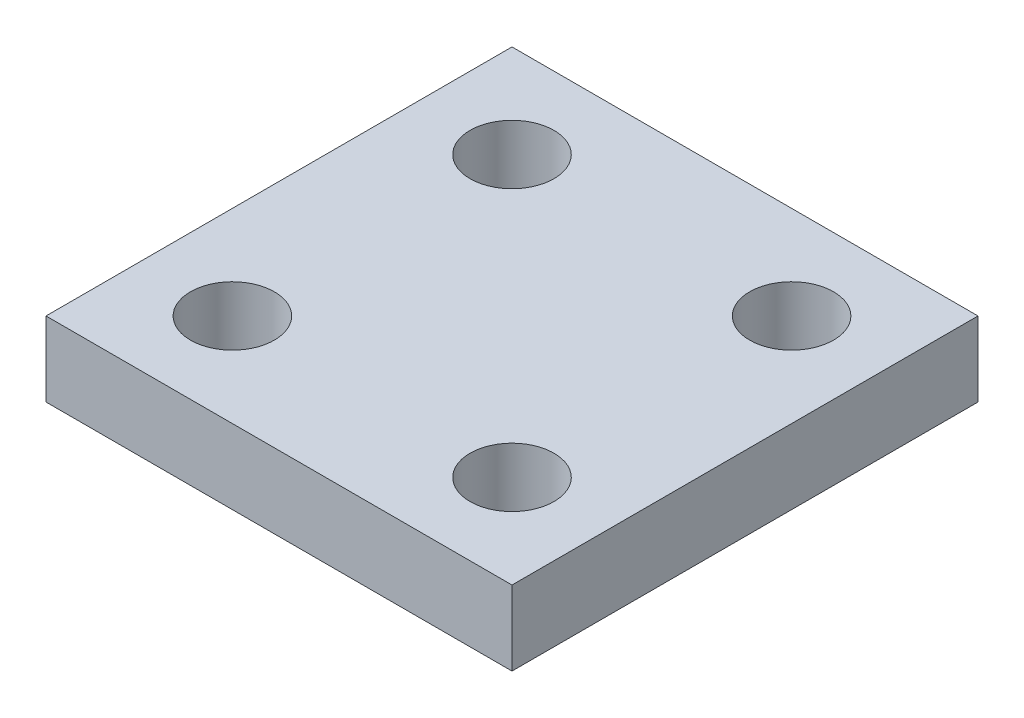
ISO-10303-21;
HEADER;
FILE_DESCRIPTION(('STEP AP214'),'2;1');
FILE_NAME('part.step','',(''),(''),'','','');
FILE_SCHEMA(('AUTOMOTIVE_DESIGN { 1 0 10303 214 1 1 1 1 }'));
ENDSEC;
DATA;
#1=APPLICATION_CONTEXT('core data for automotive mechanical design processes');
#2=APPLICATION_PROTOCOL_DEFINITION('international standard','automotive_design',2000,#1);
#3=PRODUCT_CONTEXT('',#1,'mechanical');
#4=PRODUCT('Part','Part','',(#3));
#5=PRODUCT_RELATED_PRODUCT_CATEGORY('part','',(#4));
#6=PRODUCT_DEFINITION_FORMATION('','',#4);
#7=PRODUCT_DEFINITION_CONTEXT('part definition',#1,'design');
#8=PRODUCT_DEFINITION('design','',#6,#7);
#9=PRODUCT_DEFINITION_SHAPE('','',#8);
#10=(LENGTH_UNIT() NAMED_UNIT(*) SI_UNIT(.MILLI.,.METRE.));
#11=(NAMED_UNIT(*) PLANE_ANGLE_UNIT() SI_UNIT($,.RADIAN.));
#12=(NAMED_UNIT(*) SI_UNIT($,.STERADIAN.) SOLID_ANGLE_UNIT());
#13=UNCERTAINTY_MEASURE_WITH_UNIT(LENGTH_MEASURE(1.E-05),#10,'distance_accuracy_value','');
#14=(GEOMETRIC_REPRESENTATION_CONTEXT(3) GLOBAL_UNCERTAINTY_ASSIGNED_CONTEXT((#13)) GLOBAL_UNIT_ASSIGNED_CONTEXT((#10,
#11,#12)) REPRESENTATION_CONTEXT('',''));
#15=CARTESIAN_POINT('',(0.,0.,0.));
#16=DIRECTION('',(0.,0.,1.));
#17=DIRECTION('',(1.,0.,0.));
#18=AXIS2_PLACEMENT_3D('',#15,#16,#17);
#19=CARTESIAN_POINT('',(0.,4.,0.));
#20=DIRECTION('',(0.,1.,0.));
#21=DIRECTION('',(0.,0.,1.));
#22=AXIS2_PLACEMENT_3D('',#19,#20,#21);
#23=PLANE('',#22);
#24=CARTESIAN_POINT('',(-7.5,4.,7.5));
#25=DIRECTION('',(0.,1.,0.));
#26=DIRECTION('',(0.,0.,1.));
#27=AXIS2_PLACEMENT_3D('',#24,#25,#26);
#28=CIRCLE('',#27,2.25);
#29=CARTESIAN_POINT('',(-7.5,4.,9.75));
#30=VERTEX_POINT('',#29);
#31=EDGE_CURVE('E122',#30,#30,#28,.T.);
#32=ORIENTED_EDGE('',*,*,#31,.F.);
#33=EDGE_LOOP('',(#32));
#34=FACE_BOUND('',#33,.T.);
#35=CARTESIAN_POINT('',(-7.5,4.,-7.5));
#36=DIRECTION('',(0.,1.,0.));
#37=DIRECTION('',(0.,0.,1.));
#38=AXIS2_PLACEMENT_3D('',#35,#36,#37);
#39=CIRCLE('',#38,2.25);
#40=CARTESIAN_POINT('',(-7.5,4.,-5.25));
#41=VERTEX_POINT('',#40);
#42=EDGE_CURVE('E101',#41,#41,#39,.T.);
#43=ORIENTED_EDGE('',*,*,#42,.F.);
#44=EDGE_LOOP('',(#43));
#45=FACE_BOUND('',#44,.T.);
#46=DIRECTION('',(0.,0.,-1.));
#47=VECTOR('',#46,1.);
#48=CARTESIAN_POINT('',(12.5,4.,-12.5));
#49=LINE('',#48,#47);
#50=CARTESIAN_POINT('',(12.5,4.,12.5));
#51=VERTEX_POINT('',#50);
#52=CARTESIAN_POINT('',(12.5,4.,-12.5));
#53=VERTEX_POINT('',#52);
#54=EDGE_CURVE('E86',#51,#53,#49,.T.);
#55=ORIENTED_EDGE('',*,*,#54,.T.);
#56=DIRECTION('',(-1.,0.,0.));
#57=VECTOR('',#56,1.);
#58=CARTESIAN_POINT('',(-12.5,4.,-12.5));
#59=LINE('',#58,#57);
#60=CARTESIAN_POINT('',(-12.5,4.,-12.5));
#61=VERTEX_POINT('',#60);
#62=EDGE_CURVE('E81',#53,#61,#59,.T.);
#63=ORIENTED_EDGE('',*,*,#62,.T.);
#64=DIRECTION('',(0.,0.,1.));
#65=VECTOR('',#64,1.);
#66=CARTESIAN_POINT('',(-12.5,4.,-12.5));
#67=LINE('',#66,#65);
#68=CARTESIAN_POINT('',(-12.5,4.,12.5));
#69=VERTEX_POINT('',#68);
#70=EDGE_CURVE('E84',#61,#69,#67,.T.);
#71=ORIENTED_EDGE('',*,*,#70,.T.);
#72=DIRECTION('',(1.,0.,0.));
#73=VECTOR('',#72,1.);
#74=CARTESIAN_POINT('',(-12.5,4.,12.5));
#75=LINE('',#74,#73);
#76=EDGE_CURVE('E51',#69,#51,#75,.T.);
#77=ORIENTED_EDGE('',*,*,#76,.T.);
#78=EDGE_LOOP('',(#55,#63,#71,#77));
#79=FACE_BOUND('',#78,.T.);
#80=CARTESIAN_POINT('',(7.5,4.,7.5));
#81=DIRECTION('',(0.,1.,0.));
#82=DIRECTION('',(0.,0.,1.));
#83=AXIS2_PLACEMENT_3D('',#80,#81,#82);
#84=CIRCLE('',#83,2.25);
#85=CARTESIAN_POINT('',(7.5,4.,9.75));
#86=VERTEX_POINT('',#85);
#87=EDGE_CURVE('E116',#86,#86,#84,.T.);
#88=ORIENTED_EDGE('',*,*,#87,.F.);
#89=EDGE_LOOP('',(#88));
#90=FACE_BOUND('',#89,.T.);
#91=CARTESIAN_POINT('',(7.5,4.,-7.5));
#92=DIRECTION('',(0.,1.,0.));
#93=DIRECTION('',(0.,0.,1.));
#94=AXIS2_PLACEMENT_3D('',#91,#92,#93);
#95=CIRCLE('',#94,2.25000000000001);
#96=CARTESIAN_POINT('',(7.5,4.,-5.25));
#97=VERTEX_POINT('',#96);
#98=EDGE_CURVE('E128',#97,#97,#95,.T.);
#99=ORIENTED_EDGE('',*,*,#98,.F.);
#100=EDGE_LOOP('',(#99));
#101=FACE_BOUND('',#100,.T.);
#102=ADVANCED_FACE('F34',(#34,#45,#79,#90,#101),#23,.T.);
#103=CARTESIAN_POINT('',(0.,0.,0.));
#104=DIRECTION('',(0.,1.,0.));
#105=DIRECTION('',(0.,0.,1.));
#106=AXIS2_PLACEMENT_3D('',#103,#104,#105);
#107=PLANE('',#106);
#108=DIRECTION('',(0.,0.,-1.));
#109=VECTOR('',#108,1.);
#110=CARTESIAN_POINT('',(12.5,0.,-12.5));
#111=LINE('',#110,#109);
#112=CARTESIAN_POINT('',(12.5,0.,12.5));
#113=VERTEX_POINT('',#112);
#114=CARTESIAN_POINT('',(12.5,0.,-12.5));
#115=VERTEX_POINT('',#114);
#116=EDGE_CURVE('E98',#113,#115,#111,.T.);
#117=ORIENTED_EDGE('',*,*,#116,.F.);
#118=DIRECTION('',(1.,0.,0.));
#119=VECTOR('',#118,1.);
#120=CARTESIAN_POINT('',(-12.5,0.,12.5));
#121=LINE('',#120,#119);
#122=CARTESIAN_POINT('',(-12.5,0.,12.5));
#123=VERTEX_POINT('',#122);
#124=EDGE_CURVE('E74',#123,#113,#121,.T.);
#125=ORIENTED_EDGE('',*,*,#124,.F.);
#126=DIRECTION('',(0.,0.,1.));
#127=VECTOR('',#126,1.);
#128=CARTESIAN_POINT('',(-12.5,0.,-12.5));
#129=LINE('',#128,#127);
#130=CARTESIAN_POINT('',(-12.5,0.,-12.5));
#131=VERTEX_POINT('',#130);
#132=EDGE_CURVE('E68',#131,#123,#129,.T.);
#133=ORIENTED_EDGE('',*,*,#132,.F.);
#134=DIRECTION('',(-1.,0.,0.));
#135=VECTOR('',#134,1.);
#136=CARTESIAN_POINT('',(-12.5,0.,-12.5));
#137=LINE('',#136,#135);
#138=EDGE_CURVE('E90',#115,#131,#137,.T.);
#139=ORIENTED_EDGE('',*,*,#138,.F.);
#140=EDGE_LOOP('',(#117,#125,#133,#139));
#141=FACE_BOUND('',#140,.T.);
#142=CARTESIAN_POINT('',(-7.5,0.,-7.5));
#143=DIRECTION('',(0.,1.,0.));
#144=DIRECTION('',(0.,0.,1.));
#145=AXIS2_PLACEMENT_3D('',#142,#143,#144);
#146=CIRCLE('',#145,2.25);
#147=CARTESIAN_POINT('',(-7.5,0.,-5.25));
#148=VERTEX_POINT('',#147);
#149=EDGE_CURVE('E113',#148,#148,#146,.T.);
#150=ORIENTED_EDGE('',*,*,#149,.T.);
#151=EDGE_LOOP('',(#150));
#152=FACE_BOUND('',#151,.T.);
#153=CARTESIAN_POINT('',(7.5,0.,7.5));
#154=DIRECTION('',(0.,1.,0.));
#155=DIRECTION('',(0.,0.,1.));
#156=AXIS2_PLACEMENT_3D('',#153,#154,#155);
#157=CIRCLE('',#156,2.25);
#158=CARTESIAN_POINT('',(7.5,0.,9.75));
#159=VERTEX_POINT('',#158);
#160=EDGE_CURVE('E119',#159,#159,#157,.T.);
#161=ORIENTED_EDGE('',*,*,#160,.T.);
#162=EDGE_LOOP('',(#161));
#163=FACE_BOUND('',#162,.T.);
#164=CARTESIAN_POINT('',(-7.5,0.,7.5));
#165=DIRECTION('',(0.,1.,0.));
#166=DIRECTION('',(0.,0.,1.));
#167=AXIS2_PLACEMENT_3D('',#164,#165,#166);
#168=CIRCLE('',#167,2.25);
#169=CARTESIAN_POINT('',(-7.5,0.,9.75));
#170=VERTEX_POINT('',#169);
#171=EDGE_CURVE('E125',#170,#170,#168,.T.);
#172=ORIENTED_EDGE('',*,*,#171,.T.);
#173=EDGE_LOOP('',(#172));
#174=FACE_BOUND('',#173,.T.);
#175=CARTESIAN_POINT('',(7.5,0.,-7.5));
#176=DIRECTION('',(0.,1.,0.));
#177=DIRECTION('',(0.,0.,1.));
#178=AXIS2_PLACEMENT_3D('',#175,#176,#177);
#179=CIRCLE('',#178,2.25000000000001);
#180=CARTESIAN_POINT('',(7.5,0.,-5.25));
#181=VERTEX_POINT('',#180);
#182=EDGE_CURVE('E131',#181,#181,#179,.T.);
#183=ORIENTED_EDGE('',*,*,#182,.T.);
#184=EDGE_LOOP('',(#183));
#185=FACE_BOUND('',#184,.T.);
#186=ADVANCED_FACE('F109',(#141,#152,#163,#174,#185),#107,.F.);
#187=CARTESIAN_POINT('',(12.5,4.,-12.5));
#188=DIRECTION('',(-1.,0.,0.));
#189=DIRECTION('',(0.,0.,1.));
#190=AXIS2_PLACEMENT_3D('',#187,#188,#189);
#191=PLANE('',#190);
#192=ORIENTED_EDGE('',*,*,#116,.T.);
#193=DIRECTION('',(0.,-1.,0.));
#194=VECTOR('',#193,1.);
#195=CARTESIAN_POINT('',(12.5,4.,-12.5));
#196=LINE('',#195,#194);
#197=EDGE_CURVE('E11',#53,#115,#196,.T.);
#198=ORIENTED_EDGE('',*,*,#197,.F.);
#199=ORIENTED_EDGE('',*,*,#54,.F.);
#200=DIRECTION('',(0.,-1.,0.));
#201=VECTOR('',#200,1.);
#202=CARTESIAN_POINT('',(12.5,4.,12.5));
#203=LINE('',#202,#201);
#204=EDGE_CURVE('E94',#51,#113,#203,.T.);
#205=ORIENTED_EDGE('',*,*,#204,.T.);
#206=EDGE_LOOP('',(#192,#198,#199,#205));
#207=FACE_BOUND('',#206,.T.);
#208=ADVANCED_FACE('F36',(#207),#191,.F.);
#209=CARTESIAN_POINT('',(-12.5,4.,-12.5));
#210=DIRECTION('',(0.,0.,1.));
#211=DIRECTION('',(1.,0.,0.));
#212=AXIS2_PLACEMENT_3D('',#209,#210,#211);
#213=PLANE('',#212);
#214=ORIENTED_EDGE('',*,*,#138,.T.);
#215=DIRECTION('',(0.,-1.,0.));
#216=VECTOR('',#215,1.);
#217=CARTESIAN_POINT('',(-12.5,4.,-12.5));
#218=LINE('',#217,#216);
#219=EDGE_CURVE('E43',#61,#131,#218,.T.);
#220=ORIENTED_EDGE('',*,*,#219,.F.);
#221=ORIENTED_EDGE('',*,*,#62,.F.);
#222=ORIENTED_EDGE('',*,*,#197,.T.);
#223=EDGE_LOOP('',(#214,#220,#221,#222));
#224=FACE_BOUND('',#223,.T.);
#225=ADVANCED_FACE('F89',(#224),#213,.F.);
#226=CARTESIAN_POINT('',(-12.5,4.,-12.5));
#227=DIRECTION('',(1.,0.,0.));
#228=DIRECTION('',(0.,0.,-1.));
#229=AXIS2_PLACEMENT_3D('',#226,#227,#228);
#230=PLANE('',#229);
#231=ORIENTED_EDGE('',*,*,#132,.T.);
#232=DIRECTION('',(0.,-1.,0.));
#233=VECTOR('',#232,1.);
#234=CARTESIAN_POINT('',(-12.5,4.,12.5));
#235=LINE('',#234,#233);
#236=EDGE_CURVE('E91',#69,#123,#235,.T.);
#237=ORIENTED_EDGE('',*,*,#236,.F.);
#238=ORIENTED_EDGE('',*,*,#70,.F.);
#239=ORIENTED_EDGE('',*,*,#219,.T.);
#240=EDGE_LOOP('',(#231,#237,#238,#239));
#241=FACE_BOUND('',#240,.T.);
#242=ADVANCED_FACE('F92',(#241),#230,.F.);
#243=CARTESIAN_POINT('',(-12.5,4.,12.5));
#244=DIRECTION('',(0.,0.,-1.));
#245=DIRECTION('',(-1.,0.,0.));
#246=AXIS2_PLACEMENT_3D('',#243,#244,#245);
#247=PLANE('',#246);
#248=ORIENTED_EDGE('',*,*,#124,.T.);
#249=ORIENTED_EDGE('',*,*,#204,.F.);
#250=ORIENTED_EDGE('',*,*,#76,.F.);
#251=ORIENTED_EDGE('',*,*,#236,.T.);
#252=EDGE_LOOP('',(#248,#249,#250,#251));
#253=FACE_BOUND('',#252,.T.);
#254=ADVANCED_FACE('F106',(#253),#247,.F.);
#255=CARTESIAN_POINT('',(-7.5,4.,-7.5));
#256=DIRECTION('',(0.,-1.,0.));
#257=DIRECTION('',(0.,0.,-1.));
#258=AXIS2_PLACEMENT_3D('',#255,#256,#257);
#259=CYLINDRICAL_SURFACE('',#258,2.25);
#260=ORIENTED_EDGE('',*,*,#42,.T.);
#261=EDGE_LOOP('',(#260));
#262=FACE_BOUND('',#261,.T.);
#263=ORIENTED_EDGE('',*,*,#149,.F.);
#264=EDGE_LOOP('',(#263));
#265=FACE_BOUND('',#264,.T.);
#266=ADVANCED_FACE('F150',(#262,#265),#259,.F.);
#267=CARTESIAN_POINT('',(7.5,4.,7.5));
#268=DIRECTION('',(0.,-1.,0.));
#269=DIRECTION('',(0.,0.,-1.));
#270=AXIS2_PLACEMENT_3D('',#267,#268,#269);
#271=CYLINDRICAL_SURFACE('',#270,2.25);
#272=ORIENTED_EDGE('',*,*,#87,.T.);
#273=EDGE_LOOP('',(#272));
#274=FACE_BOUND('',#273,.T.);
#275=ORIENTED_EDGE('',*,*,#160,.F.);
#276=EDGE_LOOP('',(#275));
#277=FACE_BOUND('',#276,.T.);
#278=ADVANCED_FACE('F196',(#274,#277),#271,.F.);
#279=CARTESIAN_POINT('',(-7.5,4.,7.5));
#280=DIRECTION('',(0.,-1.,0.));
#281=DIRECTION('',(0.,0.,-1.));
#282=AXIS2_PLACEMENT_3D('',#279,#280,#281);
#283=CYLINDRICAL_SURFACE('',#282,2.25);
#284=ORIENTED_EDGE('',*,*,#31,.T.);
#285=EDGE_LOOP('',(#284));
#286=FACE_BOUND('',#285,.T.);
#287=ORIENTED_EDGE('',*,*,#171,.F.);
#288=EDGE_LOOP('',(#287));
#289=FACE_BOUND('',#288,.T.);
#290=ADVANCED_FACE('F204',(#286,#289),#283,.F.);
#291=CARTESIAN_POINT('',(7.5,4.,-7.5));
#292=DIRECTION('',(0.,-1.,0.));
#293=DIRECTION('',(0.,0.,-1.));
#294=AXIS2_PLACEMENT_3D('',#291,#292,#293);
#295=CYLINDRICAL_SURFACE('',#294,2.25000000000001);
#296=ORIENTED_EDGE('',*,*,#98,.T.);
#297=EDGE_LOOP('',(#296));
#298=FACE_BOUND('',#297,.T.);
#299=ORIENTED_EDGE('',*,*,#182,.F.);
#300=EDGE_LOOP('',(#299));
#301=FACE_BOUND('',#300,.T.);
#302=ADVANCED_FACE('F137',(#298,#301),#295,.F.);
#303=CLOSED_SHELL('',(#102,#186,#208,#225,#242,#254,#266,#278,#290,#302));
#304=MANIFOLD_SOLID_BREP('B2',#303);
#305=ADVANCED_BREP_SHAPE_REPRESENTATION('',(#18,#304),#14);
#306=SHAPE_DEFINITION_REPRESENTATION(#9,#305);
ENDSEC;
END-ISO-10303-21;
